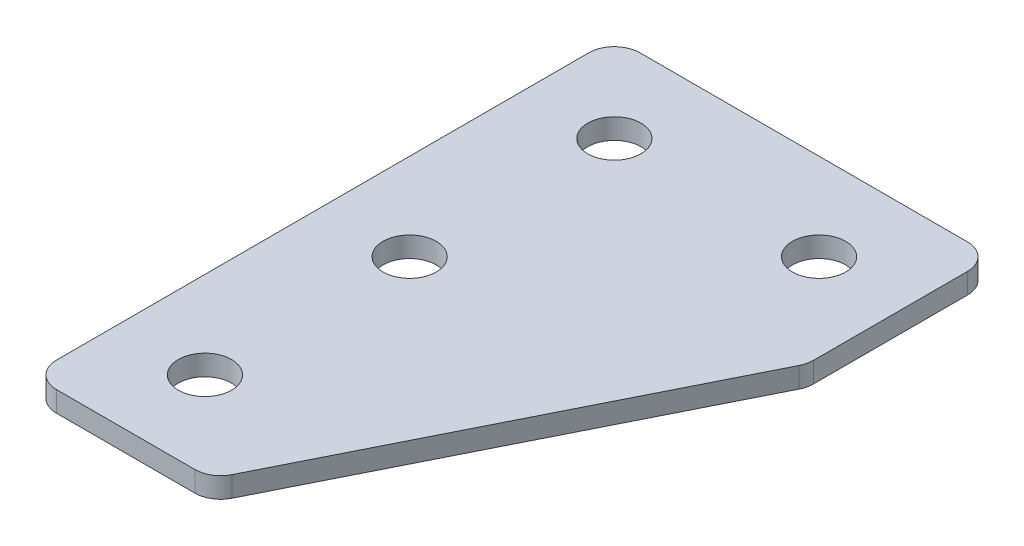
ISO-10303-21;
HEADER;
FILE_DESCRIPTION(('STEP AP214'),'2;1');
FILE_NAME('part.step','',(''),(''),'','','');
FILE_SCHEMA(('AUTOMOTIVE_DESIGN { 1 0 10303 214 1 1 1 1 }'));
ENDSEC;
DATA;
#1=APPLICATION_CONTEXT('core data for automotive mechanical design processes');
#2=APPLICATION_PROTOCOL_DEFINITION('international standard','automotive_design',2000,#1);
#3=PRODUCT_CONTEXT('',#1,'mechanical');
#4=PRODUCT('Part','Part','',(#3));
#5=PRODUCT_RELATED_PRODUCT_CATEGORY('part','',(#4));
#6=PRODUCT_DEFINITION_FORMATION('','',#4);
#7=PRODUCT_DEFINITION_CONTEXT('part definition',#1,'design');
#8=PRODUCT_DEFINITION('design','',#6,#7);
#9=PRODUCT_DEFINITION_SHAPE('','',#8);
#10=(LENGTH_UNIT() NAMED_UNIT(*) SI_UNIT(.MILLI.,.METRE.));
#11=(NAMED_UNIT(*) PLANE_ANGLE_UNIT() SI_UNIT($,.RADIAN.));
#12=(NAMED_UNIT(*) SI_UNIT($,.STERADIAN.) SOLID_ANGLE_UNIT());
#13=UNCERTAINTY_MEASURE_WITH_UNIT(LENGTH_MEASURE(1.E-05),#10,'distance_accuracy_value','');
#14=(GEOMETRIC_REPRESENTATION_CONTEXT(3) GLOBAL_UNCERTAINTY_ASSIGNED_CONTEXT((#13)) GLOBAL_UNIT_ASSIGNED_CONTEXT((#10,
#11,#12)) REPRESENTATION_CONTEXT('',''));
#15=CARTESIAN_POINT('',(0.,0.,0.));
#16=DIRECTION('',(0.,0.,1.));
#17=DIRECTION('',(1.,0.,0.));
#18=AXIS2_PLACEMENT_3D('',#15,#16,#17);
#19=CARTESIAN_POINT('',(-12.3412324850369,2.35790424429661,-21.016126049933));
#20=DIRECTION('',(0.,-1.,0.));
#21=DIRECTION('',(0.,0.,-1.));
#22=AXIS2_PLACEMENT_3D('',#19,#20,#21);
#23=PLANE('',#22);
#24=CARTESIAN_POINT('',(-12.3412324850369,2.35790424429661,18.983873950067));
#25=DIRECTION('',(0.,1.,0.));
#26=DIRECTION('',(0.,0.,1.));
#27=AXIS2_PLACEMENT_3D('',#24,#25,#26);
#28=CIRCLE('',#27,2.6);
#29=CARTESIAN_POINT('',(-12.3412324850369,2.35790424429661,21.583873950067));
#30=VERTEX_POINT('',#29);
#31=EDGE_CURVE('E253',#30,#30,#28,.T.);
#32=ORIENTED_EDGE('',*,*,#31,.T.);
#33=EDGE_LOOP('',(#32));
#34=FACE_BOUND('',#33,.T.);
#35=CARTESIAN_POINT('',(-12.3412324850369,2.35790424429661,-1.01612604993302));
#36=DIRECTION('',(0.,1.,0.));
#37=DIRECTION('',(0.,0.,1.));
#38=AXIS2_PLACEMENT_3D('',#35,#36,#37);
#39=CIRCLE('',#38,2.6);
#40=CARTESIAN_POINT('',(-12.3412324850369,2.35790424429661,1.58387395006698));
#41=VERTEX_POINT('',#40);
#42=EDGE_CURVE('E248',#41,#41,#39,.T.);
#43=ORIENTED_EDGE('',*,*,#42,.T.);
#44=EDGE_LOOP('',(#43));
#45=FACE_BOUND('',#44,.T.);
#46=CARTESIAN_POINT('',(7.65876751496314,2.35790424429661,-21.016126049933));
#47=DIRECTION('',(0.,1.,0.));
#48=DIRECTION('',(0.,0.,1.));
#49=AXIS2_PLACEMENT_3D('',#46,#47,#48);
#50=CIRCLE('',#49,2.6);
#51=CARTESIAN_POINT('',(7.65876751496314,2.35790424429661,-18.416126049933));
#52=VERTEX_POINT('',#51);
#53=EDGE_CURVE('E261',#52,#52,#50,.T.);
#54=ORIENTED_EDGE('',*,*,#53,.T.);
#55=EDGE_LOOP('',(#54));
#56=FACE_BOUND('',#55,.T.);
#57=CARTESIAN_POINT('',(-12.3412324850369,2.35790424429661,-21.016126049933));
#58=DIRECTION('',(0.,1.,0.));
#59=DIRECTION('',(0.,0.,1.));
#60=AXIS2_PLACEMENT_3D('',#57,#58,#59);
#61=CIRCLE('',#60,2.6);
#62=CARTESIAN_POINT('',(-12.3412324850369,2.35790424429661,-18.416126049933));
#63=VERTEX_POINT('',#62);
#64=EDGE_CURVE('E177',#63,#63,#61,.T.);
#65=ORIENTED_EDGE('',*,*,#64,.T.);
#66=EDGE_LOOP('',(#65));
#67=FACE_BOUND('',#66,.T.);
#68=DIRECTION('',(1.,0.,0.));
#69=VECTOR('',#68,1.);
#70=CARTESIAN_POINT('',(-20.8412324850369,2.35790424429661,27.4838739500669));
#71=LINE('',#70,#69);
#72=CARTESIAN_POINT('',(-18.3412324850369,2.35790424429661,27.4838739500669));
#73=VERTEX_POINT('',#72);
#74=CARTESIAN_POINT('',(-4.81336844003639,2.35790424429661,27.4838739500669));
#75=VERTEX_POINT('',#74);
#76=EDGE_CURVE('E166',#73,#75,#71,.T.);
#77=ORIENTED_EDGE('',*,*,#76,.F.);
#78=CARTESIAN_POINT('',(-18.3412324850369,2.35790424429661,24.9838739500669));
#79=DIRECTION('',(0.,-1.,0.));
#80=DIRECTION('',(0.,0.,-1.));
#81=AXIS2_PLACEMENT_3D('',#78,#79,#80);
#82=CIRCLE('',#81,2.5);
#83=CARTESIAN_POINT('',(-20.8412324850369,2.35790424429661,24.9838739500669));
#84=VERTEX_POINT('',#83);
#85=EDGE_CURVE('E147',#73,#84,#82,.T.);
#86=ORIENTED_EDGE('',*,*,#85,.T.);
#87=DIRECTION('',(0.,0.,1.));
#88=VECTOR('',#87,1.);
#89=CARTESIAN_POINT('',(-20.8412324850369,2.35790424429661,-29.5161260499331));
#90=LINE('',#89,#88);
#91=CARTESIAN_POINT('',(-20.8412324850369,2.35790424429661,-27.0161260499331));
#92=VERTEX_POINT('',#91);
#93=EDGE_CURVE('E164',#92,#84,#90,.T.);
#94=ORIENTED_EDGE('',*,*,#93,.F.);
#95=CARTESIAN_POINT('',(-18.3412324850369,2.35790424429661,-27.0161260499331));
#96=DIRECTION('',(0.,-1.,0.));
#97=DIRECTION('',(0.,0.,-1.));
#98=AXIS2_PLACEMENT_3D('',#95,#96,#97);
#99=CIRCLE('',#98,2.5);
#100=CARTESIAN_POINT('',(-18.3412324850369,2.35790424429661,-29.5161260499331));
#101=VERTEX_POINT('',#100);
#102=EDGE_CURVE('E119',#92,#101,#99,.T.);
#103=ORIENTED_EDGE('',*,*,#102,.T.);
#104=DIRECTION('',(-1.,0.,0.));
#105=VECTOR('',#104,1.);
#106=CARTESIAN_POINT('',(16.1587675149631,2.35790424429661,-29.5161260499331));
#107=LINE('',#106,#105);
#108=CARTESIAN_POINT('',(13.6587675149631,2.35790424429661,-29.5161260499331));
#109=VERTEX_POINT('',#108);
#110=EDGE_CURVE('E162',#109,#101,#107,.T.);
#111=ORIENTED_EDGE('',*,*,#110,.F.);
#112=CARTESIAN_POINT('',(13.6587675149631,2.35790424429661,-27.0161260499331));
#113=DIRECTION('',(0.,-1.,0.));
#114=DIRECTION('',(0.,0.,-1.));
#115=AXIS2_PLACEMENT_3D('',#112,#113,#114);
#116=CIRCLE('',#115,2.5);
#117=CARTESIAN_POINT('',(16.1587675149631,2.35790424429661,-27.0161260499331));
#118=VERTEX_POINT('',#117);
#119=EDGE_CURVE('E144',#109,#118,#116,.T.);
#120=ORIENTED_EDGE('',*,*,#119,.T.);
#121=DIRECTION('',(0.,0.,-1.));
#122=VECTOR('',#121,1.);
#123=CARTESIAN_POINT('',(16.1587675149631,2.35790424429661,-11.3702280161827));
#124=LINE('',#123,#122);
#125=CARTESIAN_POINT('',(16.1587675149631,2.35790424429661,-11.9603979599321));
#126=VERTEX_POINT('',#125);
#127=EDGE_CURVE('E120',#126,#118,#124,.T.);
#128=ORIENTED_EDGE('',*,*,#127,.F.);
#129=CARTESIAN_POINT('',(13.6587675149631,2.35790424429661,-11.9603979599321));
#130=DIRECTION('',(0.,-1.,0.));
#131=DIRECTION('',(0.,0.,-1.));
#132=AXIS2_PLACEMENT_3D('',#129,#130,#131);
#133=CIRCLE('',#132,2.5);
#134=CARTESIAN_POINT('',(15.8948354924629,2.35790424429661,-10.8423639711822));
#135=VERTEX_POINT('',#134);
#136=EDGE_CURVE('E31',#126,#135,#133,.T.);
#137=ORIENTED_EDGE('',*,*,#136,.T.);
#138=DIRECTION('',(0.447213595499956,0.,-0.894427190999917));
#139=VECTOR('',#138,1.);
#140=CARTESIAN_POINT('',(-3.26828346816165,2.35790424429661,27.4838739500669));
#141=LINE('',#140,#139);
#142=CARTESIAN_POINT('',(-2.5773004625366,2.35790424429661,26.1019079388168));
#143=VERTEX_POINT('',#142);
#144=EDGE_CURVE('E124',#143,#135,#141,.T.);
#145=ORIENTED_EDGE('',*,*,#144,.F.);
#146=CARTESIAN_POINT('',(-4.81336844003639,2.35790424429661,24.9838739500669));
#147=DIRECTION('',(0.,-1.,0.));
#148=DIRECTION('',(0.,0.,-1.));
#149=AXIS2_PLACEMENT_3D('',#146,#147,#148);
#150=CIRCLE('',#149,2.5);
#151=EDGE_CURVE('E141',#143,#75,#150,.T.);
#152=ORIENTED_EDGE('',*,*,#151,.T.);
#153=EDGE_LOOP('',(#77,#86,#94,#103,#111,#120,#128,#137,#145,#152));
#154=FACE_BOUND('',#153,.T.);
#155=ADVANCED_FACE('F16',(#34,#45,#56,#67,#154),#23,.T.);
#156=CARTESIAN_POINT('',(16.1587675149631,2.35790424429661,-29.5161260499331));
#157=DIRECTION('',(0.,0.,-1.));
#158=DIRECTION('',(-1.,0.,0.));
#159=AXIS2_PLACEMENT_3D('',#156,#157,#158);
#160=PLANE('',#159);
#161=DIRECTION('',(-1.,0.,0.));
#162=VECTOR('',#161,1.);
#163=CARTESIAN_POINT('',(16.1587675149631,4.35790424429661,-29.5161260499331));
#164=LINE('',#163,#162);
#165=CARTESIAN_POINT('',(13.6587675149631,4.35790424429661,-29.5161260499331));
#166=VERTEX_POINT('',#165);
#167=CARTESIAN_POINT('',(-18.3412324850369,4.35790424429661,-29.5161260499331));
#168=VERTEX_POINT('',#167);
#169=EDGE_CURVE('E99',#166,#168,#164,.T.);
#170=ORIENTED_EDGE('',*,*,#169,.F.);
#171=DIRECTION('',(0.,1.,0.));
#172=VECTOR('',#171,1.);
#173=CARTESIAN_POINT('',(13.6587675149631,2.35790424429661,-29.5161260499331));
#174=LINE('',#173,#172);
#175=EDGE_CURVE('E10',#166,#109,#174,.F.);
#176=ORIENTED_EDGE('',*,*,#175,.T.);
#177=ORIENTED_EDGE('',*,*,#110,.T.);
#178=DIRECTION('',(0.,1.,0.));
#179=VECTOR('',#178,1.);
#180=CARTESIAN_POINT('',(-18.3412324850369,2.35790424429661,-29.5161260499331));
#181=LINE('',#180,#179);
#182=EDGE_CURVE('E24',#101,#168,#181,.T.);
#183=ORIENTED_EDGE('',*,*,#182,.T.);
#184=EDGE_LOOP('',(#170,#176,#177,#183));
#185=FACE_BOUND('',#184,.T.);
#186=ADVANCED_FACE('F159',(#185),#160,.T.);
#187=CARTESIAN_POINT('',(16.1587675149631,2.35790424429661,-11.3702280161827));
#188=DIRECTION('',(1.,0.,0.));
#189=DIRECTION('',(0.,0.,-1.));
#190=AXIS2_PLACEMENT_3D('',#187,#188,#189);
#191=PLANE('',#190);
#192=DIRECTION('',(0.,0.,-1.));
#193=VECTOR('',#192,1.);
#194=CARTESIAN_POINT('',(16.1587675149631,4.35790424429661,-11.3702280161827));
#195=LINE('',#194,#193);
#196=CARTESIAN_POINT('',(16.1587675149631,4.35790424429661,-11.9603979599321));
#197=VERTEX_POINT('',#196);
#198=CARTESIAN_POINT('',(16.1587675149631,4.35790424429661,-27.0161260499331));
#199=VERTEX_POINT('',#198);
#200=EDGE_CURVE('E127',#197,#199,#195,.T.);
#201=ORIENTED_EDGE('',*,*,#200,.F.);
#202=DIRECTION('',(0.,1.,0.));
#203=VECTOR('',#202,1.);
#204=CARTESIAN_POINT('',(16.1587675149631,2.35790424429661,-11.9603979599321));
#205=LINE('',#204,#203);
#206=EDGE_CURVE('E156',#197,#126,#205,.F.);
#207=ORIENTED_EDGE('',*,*,#206,.T.);
#208=ORIENTED_EDGE('',*,*,#127,.T.);
#209=DIRECTION('',(0.,1.,0.));
#210=VECTOR('',#209,1.);
#211=CARTESIAN_POINT('',(16.1587675149631,2.35790424429661,-27.0161260499331));
#212=LINE('',#211,#210);
#213=EDGE_CURVE('E153',#118,#199,#212,.T.);
#214=ORIENTED_EDGE('',*,*,#213,.T.);
#215=EDGE_LOOP('',(#201,#207,#208,#214));
#216=FACE_BOUND('',#215,.T.);
#217=ADVANCED_FACE('F216',(#216),#191,.T.);
#218=CARTESIAN_POINT('',(-3.26828346816165,2.35790424429661,27.4838739500669));
#219=DIRECTION('',(0.894427190999917,0.,0.447213595499956));
#220=DIRECTION('',(0.447213595499957,0.,-0.894427190999917));
#221=AXIS2_PLACEMENT_3D('',#218,#219,#220);
#222=PLANE('',#221);
#223=ORIENTED_EDGE('',*,*,#144,.T.);
#224=DIRECTION('',(0.,1.,0.));
#225=VECTOR('',#224,1.);
#226=CARTESIAN_POINT('',(15.8948354924629,2.35790424429661,-10.8423639711823));
#227=LINE('',#226,#225);
#228=CARTESIAN_POINT('',(15.8948354924629,4.35790424429661,-10.8423639711822));
#229=VERTEX_POINT('',#228);
#230=EDGE_CURVE('E150',#135,#229,#227,.T.);
#231=ORIENTED_EDGE('',*,*,#230,.T.);
#232=DIRECTION('',(0.447213595499956,0.,-0.894427190999917));
#233=VECTOR('',#232,1.);
#234=CARTESIAN_POINT('',(-3.26828346816165,4.35790424429661,27.4838739500669));
#235=LINE('',#234,#233);
#236=CARTESIAN_POINT('',(-2.5773004625366,4.35790424429661,26.1019079388168));
#237=VERTEX_POINT('',#236);
#238=EDGE_CURVE('E169',#237,#229,#235,.T.);
#239=ORIENTED_EDGE('',*,*,#238,.F.);
#240=DIRECTION('',(0.,1.,0.));
#241=VECTOR('',#240,1.);
#242=CARTESIAN_POINT('',(-2.5773004625366,2.35790424429661,26.1019079388168));
#243=LINE('',#242,#241);
#244=EDGE_CURVE('E38',#237,#143,#243,.F.);
#245=ORIENTED_EDGE('',*,*,#244,.T.);
#246=EDGE_LOOP('',(#223,#231,#239,#245));
#247=FACE_BOUND('',#246,.T.);
#248=ADVANCED_FACE('F182',(#247),#222,.T.);
#249=CARTESIAN_POINT('',(-20.8412324850369,2.35790424429661,27.4838739500669));
#250=DIRECTION('',(0.,0.,1.));
#251=DIRECTION('',(1.,0.,0.));
#252=AXIS2_PLACEMENT_3D('',#249,#250,#251);
#253=PLANE('',#252);
#254=DIRECTION('',(1.,0.,0.));
#255=VECTOR('',#254,1.);
#256=CARTESIAN_POINT('',(-20.8412324850369,4.35790424429661,27.4838739500669));
#257=LINE('',#256,#255);
#258=CARTESIAN_POINT('',(-18.3412324850369,4.35790424429661,27.4838739500669));
#259=VERTEX_POINT('',#258);
#260=CARTESIAN_POINT('',(-4.81336844003639,4.35790424429661,27.4838739500669));
#261=VERTEX_POINT('',#260);
#262=EDGE_CURVE('E115',#259,#261,#257,.T.);
#263=ORIENTED_EDGE('',*,*,#262,.F.);
#264=DIRECTION('',(0.,1.,0.));
#265=VECTOR('',#264,1.);
#266=CARTESIAN_POINT('',(-18.3412324850369,2.35790424429661,27.4838739500669));
#267=LINE('',#266,#265);
#268=EDGE_CURVE('E139',#259,#73,#267,.F.);
#269=ORIENTED_EDGE('',*,*,#268,.T.);
#270=ORIENTED_EDGE('',*,*,#76,.T.);
#271=DIRECTION('',(0.,1.,0.));
#272=VECTOR('',#271,1.);
#273=CARTESIAN_POINT('',(-4.81336844003639,2.35790424429661,27.4838739500669));
#274=LINE('',#273,#272);
#275=EDGE_CURVE('E136',#75,#261,#274,.T.);
#276=ORIENTED_EDGE('',*,*,#275,.T.);
#277=EDGE_LOOP('',(#263,#269,#270,#276));
#278=FACE_BOUND('',#277,.T.);
#279=ADVANCED_FACE('F191',(#278),#253,.T.);
#280=CARTESIAN_POINT('',(-20.8412324850369,2.35790424429661,-29.5161260499331));
#281=DIRECTION('',(-1.,0.,0.));
#282=DIRECTION('',(0.,0.,1.));
#283=AXIS2_PLACEMENT_3D('',#280,#281,#282);
#284=PLANE('',#283);
#285=ORIENTED_EDGE('',*,*,#93,.T.);
#286=DIRECTION('',(0.,1.,0.));
#287=VECTOR('',#286,1.);
#288=CARTESIAN_POINT('',(-20.8412324850369,2.35790424429661,24.9838739500669));
#289=LINE('',#288,#287);
#290=CARTESIAN_POINT('',(-20.8412324850369,4.35790424429661,24.9838739500669));
#291=VERTEX_POINT('',#290);
#292=EDGE_CURVE('E114',#84,#291,#289,.T.);
#293=ORIENTED_EDGE('',*,*,#292,.T.);
#294=DIRECTION('',(0.,0.,1.));
#295=VECTOR('',#294,1.);
#296=CARTESIAN_POINT('',(-20.8412324850369,4.35790424429661,-29.5161260499331));
#297=LINE('',#296,#295);
#298=CARTESIAN_POINT('',(-20.8412324850369,4.35790424429661,-27.0161260499331));
#299=VERTEX_POINT('',#298);
#300=EDGE_CURVE('E97',#299,#291,#297,.T.);
#301=ORIENTED_EDGE('',*,*,#300,.F.);
#302=DIRECTION('',(0.,1.,0.));
#303=VECTOR('',#302,1.);
#304=CARTESIAN_POINT('',(-20.8412324850369,2.35790424429661,-27.0161260499331));
#305=LINE('',#304,#303);
#306=EDGE_CURVE('E111',#299,#92,#305,.F.);
#307=ORIENTED_EDGE('',*,*,#306,.T.);
#308=EDGE_LOOP('',(#285,#293,#301,#307));
#309=FACE_BOUND('',#308,.T.);
#310=ADVANCED_FACE('F110',(#309),#284,.T.);
#311=CARTESIAN_POINT('',(-12.3412324850369,4.35790424429661,-21.016126049933));
#312=DIRECTION('',(0.,-1.,0.));
#313=DIRECTION('',(0.,0.,-1.));
#314=AXIS2_PLACEMENT_3D('',#311,#312,#313);
#315=PLANE('',#314);
#316=CARTESIAN_POINT('',(-12.3412324850369,4.35790424429661,18.983873950067));
#317=DIRECTION('',(0.,1.,0.));
#318=DIRECTION('',(0.,0.,1.));
#319=AXIS2_PLACEMENT_3D('',#316,#317,#318);
#320=CIRCLE('',#319,2.6);
#321=CARTESIAN_POINT('',(-12.3412324850369,4.35790424429661,21.583873950067));
#322=VERTEX_POINT('',#321);
#323=EDGE_CURVE('E257',#322,#322,#320,.T.);
#324=ORIENTED_EDGE('',*,*,#323,.F.);
#325=EDGE_LOOP('',(#324));
#326=FACE_BOUND('',#325,.T.);
#327=CARTESIAN_POINT('',(-12.3412324850369,4.35790424429661,-1.01612604993302));
#328=DIRECTION('',(0.,1.,0.));
#329=DIRECTION('',(0.,0.,1.));
#330=AXIS2_PLACEMENT_3D('',#327,#328,#329);
#331=CIRCLE('',#330,2.6);
#332=CARTESIAN_POINT('',(-12.3412324850369,4.35790424429661,1.58387395006698));
#333=VERTEX_POINT('',#332);
#334=EDGE_CURVE('E251',#333,#333,#331,.T.);
#335=ORIENTED_EDGE('',*,*,#334,.F.);
#336=EDGE_LOOP('',(#335));
#337=FACE_BOUND('',#336,.T.);
#338=CARTESIAN_POINT('',(7.65876751496314,4.35790424429661,-21.016126049933));
#339=DIRECTION('',(0.,1.,0.));
#340=DIRECTION('',(0.,0.,1.));
#341=AXIS2_PLACEMENT_3D('',#338,#339,#340);
#342=CIRCLE('',#341,2.6);
#343=CARTESIAN_POINT('',(7.65876751496314,4.35790424429661,-18.416126049933));
#344=VERTEX_POINT('',#343);
#345=EDGE_CURVE('E255',#344,#344,#342,.T.);
#346=ORIENTED_EDGE('',*,*,#345,.F.);
#347=EDGE_LOOP('',(#346));
#348=FACE_BOUND('',#347,.T.);
#349=CARTESIAN_POINT('',(-12.3412324850369,4.35790424429661,-21.016126049933));
#350=DIRECTION('',(0.,1.,0.));
#351=DIRECTION('',(0.,0.,1.));
#352=AXIS2_PLACEMENT_3D('',#349,#350,#351);
#353=CIRCLE('',#352,2.6);
#354=CARTESIAN_POINT('',(-12.3412324850369,4.35790424429661,-18.416126049933));
#355=VERTEX_POINT('',#354);
#356=EDGE_CURVE('E171',#355,#355,#353,.T.);
#357=ORIENTED_EDGE('',*,*,#356,.F.);
#358=EDGE_LOOP('',(#357));
#359=FACE_BOUND('',#358,.T.);
#360=ORIENTED_EDGE('',*,*,#300,.T.);
#361=CARTESIAN_POINT('',(-18.3412324850369,4.35790424429661,24.9838739500669));
#362=DIRECTION('',(0.,-1.,0.));
#363=DIRECTION('',(0.,0.,-1.));
#364=AXIS2_PLACEMENT_3D('',#361,#362,#363);
#365=CIRCLE('',#364,2.5);
#366=EDGE_CURVE('E134',#291,#259,#365,.F.);
#367=ORIENTED_EDGE('',*,*,#366,.T.);
#368=ORIENTED_EDGE('',*,*,#262,.T.);
#369=CARTESIAN_POINT('',(-4.81336844003639,4.35790424429661,24.9838739500669));
#370=DIRECTION('',(0.,-1.,0.));
#371=DIRECTION('',(0.,0.,-1.));
#372=AXIS2_PLACEMENT_3D('',#369,#370,#371);
#373=CIRCLE('',#372,2.5);
#374=EDGE_CURVE('E105',#261,#237,#373,.F.);
#375=ORIENTED_EDGE('',*,*,#374,.T.);
#376=ORIENTED_EDGE('',*,*,#238,.T.);
#377=CARTESIAN_POINT('',(13.6587675149631,4.35790424429661,-11.9603979599321));
#378=DIRECTION('',(0.,-1.,0.));
#379=DIRECTION('',(0.,0.,-1.));
#380=AXIS2_PLACEMENT_3D('',#377,#378,#379);
#381=CIRCLE('',#380,2.5);
#382=EDGE_CURVE('E132',#229,#197,#381,.F.);
#383=ORIENTED_EDGE('',*,*,#382,.T.);
#384=ORIENTED_EDGE('',*,*,#200,.T.);
#385=CARTESIAN_POINT('',(13.6587675149631,4.35790424429661,-27.0161260499331));
#386=DIRECTION('',(0.,-1.,0.));
#387=DIRECTION('',(0.,0.,-1.));
#388=AXIS2_PLACEMENT_3D('',#385,#386,#387);
#389=CIRCLE('',#388,2.5);
#390=EDGE_CURVE('E104',#199,#166,#389,.F.);
#391=ORIENTED_EDGE('',*,*,#390,.T.);
#392=ORIENTED_EDGE('',*,*,#169,.T.);
#393=CARTESIAN_POINT('',(-18.3412324850369,4.35790424429661,-27.0161260499331));
#394=DIRECTION('',(0.,-1.,0.));
#395=DIRECTION('',(0.,0.,-1.));
#396=AXIS2_PLACEMENT_3D('',#393,#394,#395);
#397=CIRCLE('',#396,2.5);
#398=EDGE_CURVE('E94',#168,#299,#397,.F.);
#399=ORIENTED_EDGE('',*,*,#398,.T.);
#400=EDGE_LOOP('',(#360,#367,#368,#375,#376,#383,#384,#391,#392,#399));
#401=FACE_BOUND('',#400,.T.);
#402=ADVANCED_FACE('F96',(#326,#337,#348,#359,#401),#315,.F.);
#403=CARTESIAN_POINT('',(-12.3412324850369,2.35790424429661,-21.016126049933));
#404=DIRECTION('',(0.,1.,0.));
#405=DIRECTION('',(0.,0.,1.));
#406=AXIS2_PLACEMENT_3D('',#403,#404,#405);
#407=CYLINDRICAL_SURFACE('',#406,2.6);
#408=ORIENTED_EDGE('',*,*,#64,.F.);
#409=EDGE_LOOP('',(#408));
#410=FACE_BOUND('',#409,.T.);
#411=ORIENTED_EDGE('',*,*,#356,.T.);
#412=EDGE_LOOP('',(#411));
#413=FACE_BOUND('',#412,.T.);
#414=ADVANCED_FACE('F222',(#410,#413),#407,.F.);
#415=CARTESIAN_POINT('',(7.65876751496314,2.35790424429661,-21.016126049933));
#416=DIRECTION('',(0.,1.,0.));
#417=DIRECTION('',(0.,0.,1.));
#418=AXIS2_PLACEMENT_3D('',#415,#416,#417);
#419=CYLINDRICAL_SURFACE('',#418,2.6);
#420=ORIENTED_EDGE('',*,*,#53,.F.);
#421=EDGE_LOOP('',(#420));
#422=FACE_BOUND('',#421,.T.);
#423=ORIENTED_EDGE('',*,*,#345,.T.);
#424=EDGE_LOOP('',(#423));
#425=FACE_BOUND('',#424,.T.);
#426=ADVANCED_FACE('F236',(#422,#425),#419,.F.);
#427=CARTESIAN_POINT('',(-12.3412324850369,2.35790424429661,-1.01612604993302));
#428=DIRECTION('',(0.,1.,0.));
#429=DIRECTION('',(0.,0.,1.));
#430=AXIS2_PLACEMENT_3D('',#427,#428,#429);
#431=CYLINDRICAL_SURFACE('',#430,2.6);
#432=ORIENTED_EDGE('',*,*,#42,.F.);
#433=EDGE_LOOP('',(#432));
#434=FACE_BOUND('',#433,.T.);
#435=ORIENTED_EDGE('',*,*,#334,.T.);
#436=EDGE_LOOP('',(#435));
#437=FACE_BOUND('',#436,.T.);
#438=ADVANCED_FACE('F207',(#434,#437),#431,.F.);
#439=CARTESIAN_POINT('',(-12.3412324850369,2.35790424429661,18.983873950067));
#440=DIRECTION('',(0.,1.,0.));
#441=DIRECTION('',(0.,0.,1.));
#442=AXIS2_PLACEMENT_3D('',#439,#440,#441);
#443=CYLINDRICAL_SURFACE('',#442,2.6);
#444=ORIENTED_EDGE('',*,*,#31,.F.);
#445=EDGE_LOOP('',(#444));
#446=FACE_BOUND('',#445,.T.);
#447=ORIENTED_EDGE('',*,*,#323,.T.);
#448=EDGE_LOOP('',(#447));
#449=FACE_BOUND('',#448,.T.);
#450=ADVANCED_FACE('F197',(#446,#449),#443,.F.);
#451=CARTESIAN_POINT('',(-18.3412324850369,2.35790424429661,24.9838739500669));
#452=DIRECTION('',(0.,1.,0.));
#453=DIRECTION('',(0.,0.,1.));
#454=AXIS2_PLACEMENT_3D('',#451,#452,#453);
#455=CYLINDRICAL_SURFACE('',#454,2.5);
#456=ORIENTED_EDGE('',*,*,#85,.F.);
#457=ORIENTED_EDGE('',*,*,#268,.F.);
#458=ORIENTED_EDGE('',*,*,#366,.F.);
#459=ORIENTED_EDGE('',*,*,#292,.F.);
#460=EDGE_LOOP('',(#456,#457,#458,#459));
#461=FACE_BOUND('',#460,.T.);
#462=ADVANCED_FACE('F194',(#461),#455,.T.);
#463=CARTESIAN_POINT('',(13.6587675149631,2.35790424429661,-11.9603979599321));
#464=DIRECTION('',(0.,1.,0.));
#465=DIRECTION('',(0.,0.,1.));
#466=AXIS2_PLACEMENT_3D('',#463,#464,#465);
#467=CYLINDRICAL_SURFACE('',#466,2.5);
#468=ORIENTED_EDGE('',*,*,#136,.F.);
#469=ORIENTED_EDGE('',*,*,#206,.F.);
#470=ORIENTED_EDGE('',*,*,#382,.F.);
#471=ORIENTED_EDGE('',*,*,#230,.F.);
#472=EDGE_LOOP('',(#468,#469,#470,#471));
#473=FACE_BOUND('',#472,.T.);
#474=ADVANCED_FACE('F196',(#473),#467,.T.);
#475=CARTESIAN_POINT('',(13.6587675149631,2.35790424429661,-27.0161260499331));
#476=DIRECTION('',(0.,1.,0.));
#477=DIRECTION('',(0.,0.,1.));
#478=AXIS2_PLACEMENT_3D('',#475,#476,#477);
#479=CYLINDRICAL_SURFACE('',#478,2.5);
#480=ORIENTED_EDGE('',*,*,#119,.F.);
#481=ORIENTED_EDGE('',*,*,#175,.F.);
#482=ORIENTED_EDGE('',*,*,#390,.F.);
#483=ORIENTED_EDGE('',*,*,#213,.F.);
#484=EDGE_LOOP('',(#480,#481,#482,#483));
#485=FACE_BOUND('',#484,.T.);
#486=ADVANCED_FACE('F204',(#485),#479,.T.);
#487=CARTESIAN_POINT('',(-18.3412324850369,2.35790424429661,-27.0161260499331));
#488=DIRECTION('',(0.,1.,0.));
#489=DIRECTION('',(0.,0.,1.));
#490=AXIS2_PLACEMENT_3D('',#487,#488,#489);
#491=CYLINDRICAL_SURFACE('',#490,2.5);
#492=ORIENTED_EDGE('',*,*,#102,.F.);
#493=ORIENTED_EDGE('',*,*,#306,.F.);
#494=ORIENTED_EDGE('',*,*,#398,.F.);
#495=ORIENTED_EDGE('',*,*,#182,.F.);
#496=EDGE_LOOP('',(#492,#493,#494,#495));
#497=FACE_BOUND('',#496,.T.);
#498=ADVANCED_FACE('F118',(#497),#491,.T.);
#499=CARTESIAN_POINT('',(-4.81336844003639,2.35790424429661,24.9838739500669));
#500=DIRECTION('',(0.,1.,0.));
#501=DIRECTION('',(0.,0.,1.));
#502=AXIS2_PLACEMENT_3D('',#499,#500,#501);
#503=CYLINDRICAL_SURFACE('',#502,2.5);
#504=ORIENTED_EDGE('',*,*,#151,.F.);
#505=ORIENTED_EDGE('',*,*,#244,.F.);
#506=ORIENTED_EDGE('',*,*,#374,.F.);
#507=ORIENTED_EDGE('',*,*,#275,.F.);
#508=EDGE_LOOP('',(#504,#505,#506,#507));
#509=FACE_BOUND('',#508,.T.);
#510=ADVANCED_FACE('F18',(#509),#503,.T.);
#511=CLOSED_SHELL('',(#155,#186,#217,#248,#279,#310,#402,#414,#426,#438,#450,#462,#474,#486,
#498,#510));
#512=MANIFOLD_SOLID_BREP('B1',#511);
#513=ADVANCED_BREP_SHAPE_REPRESENTATION('',(#18,#512),#14);
#514=SHAPE_DEFINITION_REPRESENTATION(#9,#513);
ENDSEC;
END-ISO-10303-21;
